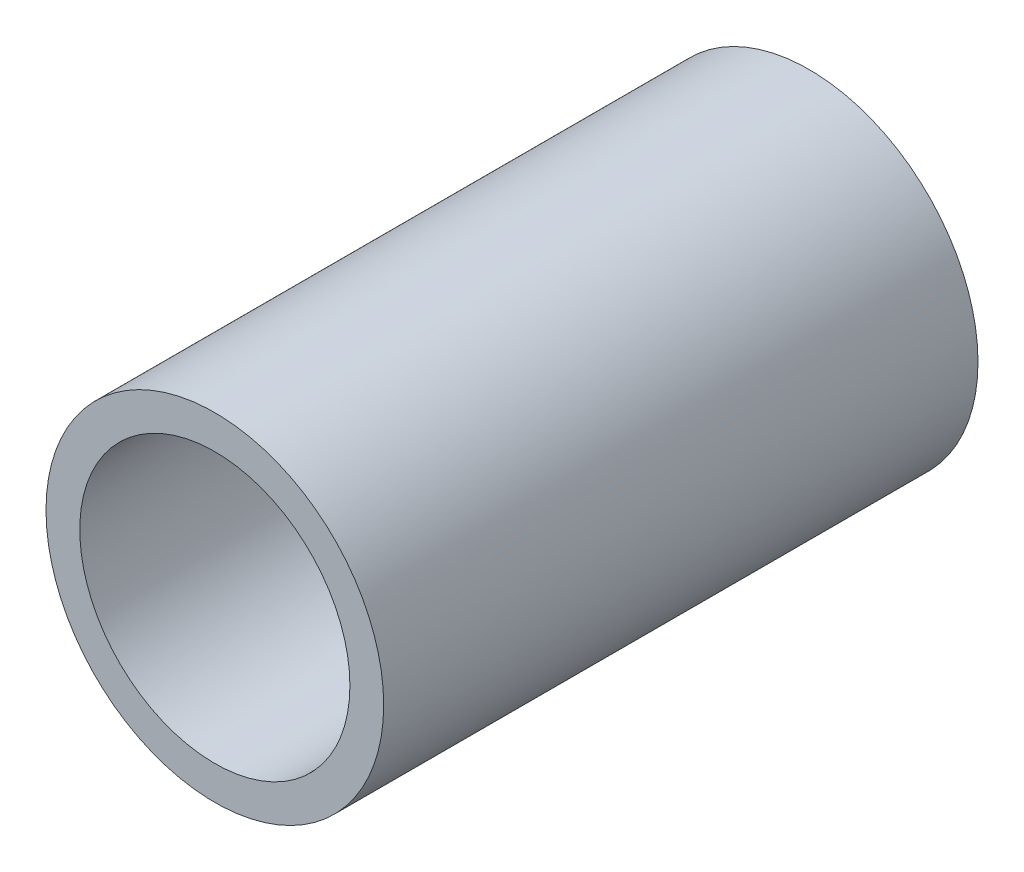
ISO-10303-21;
HEADER;
FILE_DESCRIPTION(('STEP AP214'),'2;1');
FILE_NAME('part.step','',(''),(''),'','','');
FILE_SCHEMA(('AUTOMOTIVE_DESIGN { 1 0 10303 214 1 1 1 1 }'));
ENDSEC;
DATA;
#1=APPLICATION_CONTEXT('core data for automotive mechanical design processes');
#2=APPLICATION_PROTOCOL_DEFINITION('international standard','automotive_design',2000,#1);
#3=PRODUCT_CONTEXT('',#1,'mechanical');
#4=PRODUCT('Part','Part','',(#3));
#5=PRODUCT_RELATED_PRODUCT_CATEGORY('part','',(#4));
#6=PRODUCT_DEFINITION_FORMATION('','',#4);
#7=PRODUCT_DEFINITION_CONTEXT('part definition',#1,'design');
#8=PRODUCT_DEFINITION('design','',#6,#7);
#9=PRODUCT_DEFINITION_SHAPE('','',#8);
#10=(LENGTH_UNIT() NAMED_UNIT(*) SI_UNIT(.MILLI.,.METRE.));
#11=(NAMED_UNIT(*) PLANE_ANGLE_UNIT() SI_UNIT($,.RADIAN.));
#12=(NAMED_UNIT(*) SI_UNIT($,.STERADIAN.) SOLID_ANGLE_UNIT());
#13=UNCERTAINTY_MEASURE_WITH_UNIT(LENGTH_MEASURE(1.E-05),#10,'distance_accuracy_value','');
#14=(GEOMETRIC_REPRESENTATION_CONTEXT(3) GLOBAL_UNCERTAINTY_ASSIGNED_CONTEXT((#13)) GLOBAL_UNIT_ASSIGNED_CONTEXT((#10,
#11,#12)) REPRESENTATION_CONTEXT('',''));
#15=CARTESIAN_POINT('',(0.,0.,0.));
#16=DIRECTION('',(0.,0.,1.));
#17=DIRECTION('',(1.,0.,0.));
#18=AXIS2_PLACEMENT_3D('',#15,#16,#17);
#19=CARTESIAN_POINT('',(0.,0.,154.));
#20=DIRECTION('',(0.,0.,1.));
#21=DIRECTION('',(1.,0.,0.));
#22=AXIS2_PLACEMENT_3D('',#19,#20,#21);
#23=PLANE('',#22);
#24=CARTESIAN_POINT('',(0.,0.,154.));
#25=DIRECTION('',(0.,0.,1.));
#26=DIRECTION('',(1.,0.,0.));
#27=AXIS2_PLACEMENT_3D('',#24,#25,#26);
#28=CIRCLE('',#27,43.75);
#29=CARTESIAN_POINT('',(43.75,0.,154.));
#30=VERTEX_POINT('',#29);
#31=EDGE_CURVE('E10',#30,#30,#28,.T.);
#32=ORIENTED_EDGE('',*,*,#31,.T.);
#33=EDGE_LOOP('',(#32));
#34=FACE_BOUND('',#33,.T.);
#35=CARTESIAN_POINT('',(0.,0.,154.));
#36=DIRECTION('',(0.,0.,1.));
#37=DIRECTION('',(1.,0.,0.));
#38=AXIS2_PLACEMENT_3D('',#35,#36,#37);
#39=CIRCLE('',#38,35.);
#40=CARTESIAN_POINT('',(35.,0.,154.));
#41=VERTEX_POINT('',#40);
#42=EDGE_CURVE('E50',#41,#41,#39,.T.);
#43=ORIENTED_EDGE('',*,*,#42,.F.);
#44=EDGE_LOOP('',(#43));
#45=FACE_BOUND('',#44,.T.);
#46=ADVANCED_FACE('F39',(#34,#45),#23,.T.);
#47=CARTESIAN_POINT('',(0.,0.,0.));
#48=DIRECTION('',(0.,0.,1.));
#49=DIRECTION('',(1.,0.,0.));
#50=AXIS2_PLACEMENT_3D('',#47,#48,#49);
#51=PLANE('',#50);
#52=CARTESIAN_POINT('',(0.,0.,0.));
#53=DIRECTION('',(0.,0.,1.));
#54=DIRECTION('',(1.,0.,0.));
#55=AXIS2_PLACEMENT_3D('',#52,#53,#54);
#56=CIRCLE('',#55,43.75);
#57=CARTESIAN_POINT('',(43.75,0.,0.));
#58=VERTEX_POINT('',#57);
#59=EDGE_CURVE('E43',#58,#58,#56,.T.);
#60=ORIENTED_EDGE('',*,*,#59,.F.);
#61=EDGE_LOOP('',(#60));
#62=FACE_BOUND('',#61,.T.);
#63=CARTESIAN_POINT('',(0.,0.,0.));
#64=DIRECTION('',(0.,0.,1.));
#65=DIRECTION('',(1.,0.,0.));
#66=AXIS2_PLACEMENT_3D('',#63,#64,#65);
#67=CIRCLE('',#66,35.);
#68=CARTESIAN_POINT('',(35.,0.,0.));
#69=VERTEX_POINT('',#68);
#70=EDGE_CURVE('E52',#69,#69,#67,.T.);
#71=ORIENTED_EDGE('',*,*,#70,.T.);
#72=EDGE_LOOP('',(#71));
#73=FACE_BOUND('',#72,.T.);
#74=ADVANCED_FACE('F62',(#62,#73),#51,.F.);
#75=CARTESIAN_POINT('',(0.,0.,154.));
#76=DIRECTION('',(0.,0.,-1.));
#77=DIRECTION('',(-1.,0.,0.));
#78=AXIS2_PLACEMENT_3D('',#75,#76,#77);
#79=CYLINDRICAL_SURFACE('',#78,43.75);
#80=ORIENTED_EDGE('',*,*,#31,.F.);
#81=EDGE_LOOP('',(#80));
#82=FACE_BOUND('',#81,.T.);
#83=ORIENTED_EDGE('',*,*,#59,.T.);
#84=EDGE_LOOP('',(#83));
#85=FACE_BOUND('',#84,.T.);
#86=ADVANCED_FACE('F41',(#82,#85),#79,.T.);
#87=CARTESIAN_POINT('',(0.,0.,154.));
#88=DIRECTION('',(0.,0.,-1.));
#89=DIRECTION('',(-1.,0.,0.));
#90=AXIS2_PLACEMENT_3D('',#87,#88,#89);
#91=CYLINDRICAL_SURFACE('',#90,35.);
#92=ORIENTED_EDGE('',*,*,#42,.T.);
#93=EDGE_LOOP('',(#92));
#94=FACE_BOUND('',#93,.T.);
#95=ORIENTED_EDGE('',*,*,#70,.F.);
#96=EDGE_LOOP('',(#95));
#97=FACE_BOUND('',#96,.T.);
#98=ADVANCED_FACE('F58',(#94,#97),#91,.F.);
#99=CLOSED_SHELL('',(#46,#74,#86,#98));
#100=MANIFOLD_SOLID_BREP('B2',#99);
#101=ADVANCED_BREP_SHAPE_REPRESENTATION('',(#18,#100),#14);
#102=SHAPE_DEFINITION_REPRESENTATION(#9,#101);
ENDSEC;
END-ISO-10303-21;
